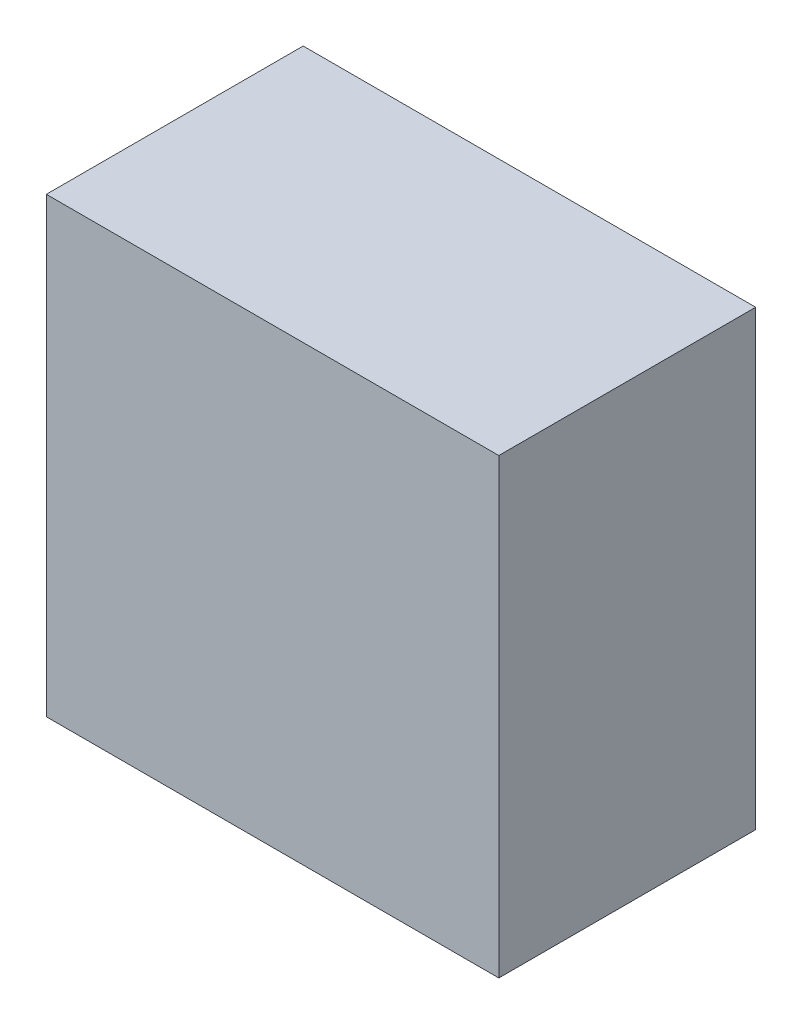
ISO-10303-21;
HEADER;
FILE_DESCRIPTION(('STEP AP214'),'2;1');
FILE_NAME('part.step','',(''),(''),'','','');
FILE_SCHEMA(('AUTOMOTIVE_DESIGN { 1 0 10303 214 1 1 1 1 }'));
ENDSEC;
DATA;
#1=APPLICATION_CONTEXT('core data for automotive mechanical design processes');
#2=APPLICATION_PROTOCOL_DEFINITION('international standard','automotive_design',2000,#1);
#3=PRODUCT_CONTEXT('',#1,'mechanical');
#4=PRODUCT('Part','Part','',(#3));
#5=PRODUCT_RELATED_PRODUCT_CATEGORY('part','',(#4));
#6=PRODUCT_DEFINITION_FORMATION('','',#4);
#7=PRODUCT_DEFINITION_CONTEXT('part definition',#1,'design');
#8=PRODUCT_DEFINITION('design','',#6,#7);
#9=PRODUCT_DEFINITION_SHAPE('','',#8);
#10=(LENGTH_UNIT() NAMED_UNIT(*) SI_UNIT(.MILLI.,.METRE.));
#11=(NAMED_UNIT(*) PLANE_ANGLE_UNIT() SI_UNIT($,.RADIAN.));
#12=(NAMED_UNIT(*) SI_UNIT($,.STERADIAN.) SOLID_ANGLE_UNIT());
#13=UNCERTAINTY_MEASURE_WITH_UNIT(LENGTH_MEASURE(1.E-05),#10,'distance_accuracy_value','');
#14=(GEOMETRIC_REPRESENTATION_CONTEXT(3) GLOBAL_UNCERTAINTY_ASSIGNED_CONTEXT((#13)) GLOBAL_UNIT_ASSIGNED_CONTEXT((#10,
#11,#12)) REPRESENTATION_CONTEXT('',''));
#15=CARTESIAN_POINT('',(0.,0.,0.));
#16=DIRECTION('',(0.,0.,1.));
#17=DIRECTION('',(1.,0.,0.));
#18=AXIS2_PLACEMENT_3D('',#15,#16,#17);
#19=CARTESIAN_POINT('',(-3.12699908,3.12699908,3.55000052));
#20=DIRECTION('',(0.,0.,1.));
#21=DIRECTION('',(1.,0.,0.));
#22=AXIS2_PLACEMENT_3D('',#19,#20,#21);
#23=PLANE('',#22);
#24=DIRECTION('',(0.,1.,0.));
#25=VECTOR('',#24,1.);
#26=CARTESIAN_POINT('',(3.12699908,3.12699908,3.55000052));
#27=LINE('',#26,#25);
#28=CARTESIAN_POINT('',(3.12699908,3.12699908,3.55000052));
#29=VERTEX_POINT('',#28);
#30=CARTESIAN_POINT('',(3.12699908,-3.12699908,3.55000052));
#31=VERTEX_POINT('',#30);
#32=EDGE_CURVE('E53',#29,#31,#27,.F.);
#33=ORIENTED_EDGE('',*,*,#32,.F.);
#34=DIRECTION('',(1.,0.,0.));
#35=VECTOR('',#34,1.);
#36=CARTESIAN_POINT('',(-3.12699908,3.12699908,3.55000052));
#37=LINE('',#36,#35);
#38=CARTESIAN_POINT('',(-3.12699908,3.12699908,3.55000052));
#39=VERTEX_POINT('',#38);
#40=EDGE_CURVE('E68',#39,#29,#37,.T.);
#41=ORIENTED_EDGE('',*,*,#40,.F.);
#42=DIRECTION('',(0.,1.,0.));
#43=VECTOR('',#42,1.);
#44=CARTESIAN_POINT('',(-3.12699908,-3.12699908,3.55000052));
#45=LINE('',#44,#43);
#46=CARTESIAN_POINT('',(-3.12699908,-3.12699908,3.55000052));
#47=VERTEX_POINT('',#46);
#48=EDGE_CURVE('E20',#47,#39,#45,.T.);
#49=ORIENTED_EDGE('',*,*,#48,.F.);
#50=DIRECTION('',(1.,0.,0.));
#51=VECTOR('',#50,1.);
#52=CARTESIAN_POINT('',(3.12699908,-3.12699908,3.55000052));
#53=LINE('',#52,#51);
#54=EDGE_CURVE('E58',#31,#47,#53,.F.);
#55=ORIENTED_EDGE('',*,*,#54,.F.);
#56=EDGE_LOOP('',(#33,#41,#49,#55));
#57=FACE_BOUND('',#56,.T.);
#58=ADVANCED_FACE('F17',(#57),#23,.T.);
#59=CARTESIAN_POINT('',(-3.12699908,-3.12699908,0.));
#60=DIRECTION('',(-1.,0.,0.));
#61=DIRECTION('',(0.,0.,1.));
#62=AXIS2_PLACEMENT_3D('',#59,#60,#61);
#63=PLANE('',#62);
#64=DIRECTION('',(0.,0.,1.));
#65=VECTOR('',#64,1.);
#66=CARTESIAN_POINT('',(-3.12699908,3.12699908,0.));
#67=LINE('',#66,#65);
#68=CARTESIAN_POINT('',(-3.12699908,3.12699908,0.));
#69=VERTEX_POINT('',#68);
#70=EDGE_CURVE('E79',#69,#39,#67,.T.);
#71=ORIENTED_EDGE('',*,*,#70,.F.);
#72=DIRECTION('',(0.,1.,0.));
#73=VECTOR('',#72,1.);
#74=CARTESIAN_POINT('',(-3.12699908,3.12699908,0.));
#75=LINE('',#74,#73);
#76=CARTESIAN_POINT('',(-3.12699908,-3.12699908,0.));
#77=VERTEX_POINT('',#76);
#78=EDGE_CURVE('E74',#69,#77,#75,.F.);
#79=ORIENTED_EDGE('',*,*,#78,.T.);
#80=DIRECTION('',(0.,0.,-1.));
#81=VECTOR('',#80,1.);
#82=CARTESIAN_POINT('',(-3.12699908,-3.12699908,0.));
#83=LINE('',#82,#81);
#84=EDGE_CURVE('E63',#47,#77,#83,.T.);
#85=ORIENTED_EDGE('',*,*,#84,.F.);
#86=ORIENTED_EDGE('',*,*,#48,.T.);
#87=EDGE_LOOP('',(#71,#79,#85,#86));
#88=FACE_BOUND('',#87,.T.);
#89=ADVANCED_FACE('F73',(#88),#63,.T.);
#90=CARTESIAN_POINT('',(3.12699908,-3.12699908,0.));
#91=DIRECTION('',(0.,-1.,0.));
#92=DIRECTION('',(0.,0.,-1.));
#93=AXIS2_PLACEMENT_3D('',#90,#91,#92);
#94=PLANE('',#93);
#95=ORIENTED_EDGE('',*,*,#84,.T.);
#96=DIRECTION('',(1.,0.,0.));
#97=VECTOR('',#96,1.);
#98=CARTESIAN_POINT('',(-3.12699908,-3.12699908,0.));
#99=LINE('',#98,#97);
#100=CARTESIAN_POINT('',(3.12699908,-3.12699908,0.));
#101=VERTEX_POINT('',#100);
#102=EDGE_CURVE('E84',#77,#101,#99,.T.);
#103=ORIENTED_EDGE('',*,*,#102,.T.);
#104=DIRECTION('',(0.,0.,-1.));
#105=VECTOR('',#104,1.);
#106=CARTESIAN_POINT('',(3.12699908,-3.12699908,0.));
#107=LINE('',#106,#105);
#108=EDGE_CURVE('E65',#31,#101,#107,.T.);
#109=ORIENTED_EDGE('',*,*,#108,.F.);
#110=ORIENTED_EDGE('',*,*,#54,.T.);
#111=EDGE_LOOP('',(#95,#103,#109,#110));
#112=FACE_BOUND('',#111,.T.);
#113=ADVANCED_FACE('F60',(#112),#94,.T.);
#114=CARTESIAN_POINT('',(3.12699908,3.12699908,0.));
#115=DIRECTION('',(1.,0.,0.));
#116=DIRECTION('',(0.,0.,-1.));
#117=AXIS2_PLACEMENT_3D('',#114,#115,#116);
#118=PLANE('',#117);
#119=ORIENTED_EDGE('',*,*,#108,.T.);
#120=DIRECTION('',(0.,1.,0.));
#121=VECTOR('',#120,1.);
#122=CARTESIAN_POINT('',(3.12699908,3.12699908,0.));
#123=LINE('',#122,#121);
#124=CARTESIAN_POINT('',(3.12699908,3.12699908,0.));
#125=VERTEX_POINT('',#124);
#126=EDGE_CURVE('E26',#101,#125,#123,.T.);
#127=ORIENTED_EDGE('',*,*,#126,.T.);
#128=DIRECTION('',(0.,0.,1.));
#129=VECTOR('',#128,1.);
#130=CARTESIAN_POINT('',(3.12699908,3.12699908,0.));
#131=LINE('',#130,#129);
#132=EDGE_CURVE('E34',#29,#125,#131,.F.);
#133=ORIENTED_EDGE('',*,*,#132,.F.);
#134=ORIENTED_EDGE('',*,*,#32,.T.);
#135=EDGE_LOOP('',(#119,#127,#133,#134));
#136=FACE_BOUND('',#135,.T.);
#137=ADVANCED_FACE('F88',(#136),#118,.T.);
#138=CARTESIAN_POINT('',(-3.12699908,3.12699908,0.));
#139=DIRECTION('',(0.,1.,0.));
#140=DIRECTION('',(0.,0.,1.));
#141=AXIS2_PLACEMENT_3D('',#138,#139,#140);
#142=PLANE('',#141);
#143=ORIENTED_EDGE('',*,*,#132,.T.);
#144=DIRECTION('',(1.,0.,0.));
#145=VECTOR('',#144,1.);
#146=CARTESIAN_POINT('',(-3.12699908,3.12699908,0.));
#147=LINE('',#146,#145);
#148=EDGE_CURVE('E11',#125,#69,#147,.F.);
#149=ORIENTED_EDGE('',*,*,#148,.T.);
#150=ORIENTED_EDGE('',*,*,#70,.T.);
#151=ORIENTED_EDGE('',*,*,#40,.T.);
#152=EDGE_LOOP('',(#143,#149,#150,#151));
#153=FACE_BOUND('',#152,.T.);
#154=ADVANCED_FACE('F91',(#153),#142,.T.);
#155=CARTESIAN_POINT('',(-3.12699908,3.12699908,0.));
#156=DIRECTION('',(0.,0.,1.));
#157=DIRECTION('',(1.,0.,0.));
#158=AXIS2_PLACEMENT_3D('',#155,#156,#157);
#159=PLANE('',#158);
#160=ORIENTED_EDGE('',*,*,#126,.F.);
#161=ORIENTED_EDGE('',*,*,#102,.F.);
#162=ORIENTED_EDGE('',*,*,#78,.F.);
#163=ORIENTED_EDGE('',*,*,#148,.F.);
#164=EDGE_LOOP('',(#160,#161,#162,#163));
#165=FACE_BOUND('',#164,.T.);
#166=ADVANCED_FACE('F90',(#165),#159,.F.);
#167=CLOSED_SHELL('',(#58,#89,#113,#137,#154,#166));
#168=MANIFOLD_SOLID_BREP('B1',#167);
#169=ADVANCED_BREP_SHAPE_REPRESENTATION('',(#18,#168),#14);
#170=SHAPE_DEFINITION_REPRESENTATION(#9,#169);
ENDSEC;
END-ISO-10303-21;
